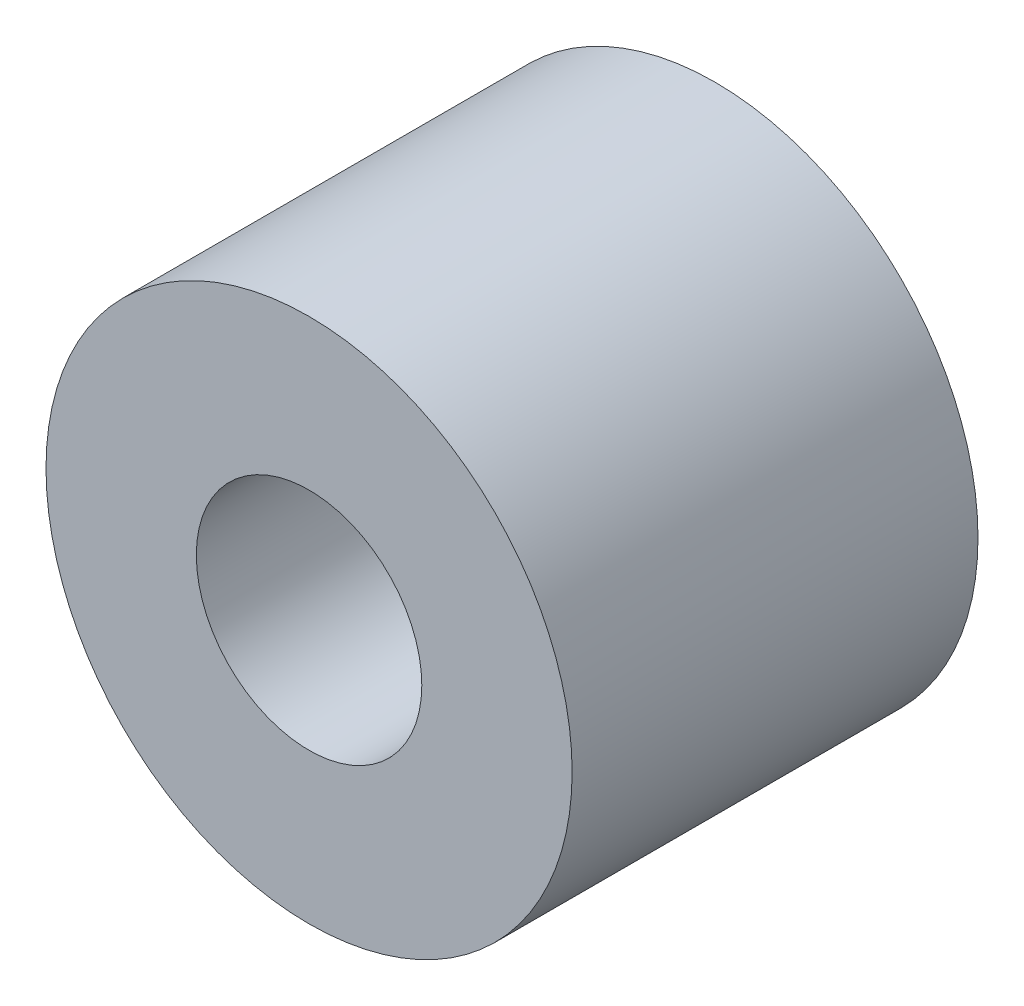
ISO-10303-21;
HEADER;
FILE_DESCRIPTION(('STEP AP214'),'2;1');
FILE_NAME('part.step','',(''),(''),'','','');
FILE_SCHEMA(('AUTOMOTIVE_DESIGN { 1 0 10303 214 1 1 1 1 }'));
ENDSEC;
DATA;
#1=APPLICATION_CONTEXT('core data for automotive mechanical design processes');
#2=APPLICATION_PROTOCOL_DEFINITION('international standard','automotive_design',2000,#1);
#3=PRODUCT_CONTEXT('',#1,'mechanical');
#4=PRODUCT('Part','Part','',(#3));
#5=PRODUCT_RELATED_PRODUCT_CATEGORY('part','',(#4));
#6=PRODUCT_DEFINITION_FORMATION('','',#4);
#7=PRODUCT_DEFINITION_CONTEXT('part definition',#1,'design');
#8=PRODUCT_DEFINITION('design','',#6,#7);
#9=PRODUCT_DEFINITION_SHAPE('','',#8);
#10=(LENGTH_UNIT() NAMED_UNIT(*) SI_UNIT(.MILLI.,.METRE.));
#11=(NAMED_UNIT(*) PLANE_ANGLE_UNIT() SI_UNIT($,.RADIAN.));
#12=(NAMED_UNIT(*) SI_UNIT($,.STERADIAN.) SOLID_ANGLE_UNIT());
#13=UNCERTAINTY_MEASURE_WITH_UNIT(LENGTH_MEASURE(1.E-05),#10,'distance_accuracy_value','');
#14=(GEOMETRIC_REPRESENTATION_CONTEXT(3) GLOBAL_UNCERTAINTY_ASSIGNED_CONTEXT((#13)) GLOBAL_UNIT_ASSIGNED_CONTEXT((#10,
#11,#12)) REPRESENTATION_CONTEXT('',''));
#15=CARTESIAN_POINT('',(0.,0.,0.));
#16=DIRECTION('',(0.,0.,1.));
#17=DIRECTION('',(1.,0.,0.));
#18=AXIS2_PLACEMENT_3D('',#15,#16,#17);
#19=CARTESIAN_POINT('',(0.,0.,5.4));
#20=DIRECTION('',(0.,0.,1.));
#21=DIRECTION('',(1.,0.,0.));
#22=AXIS2_PLACEMENT_3D('',#19,#20,#21);
#23=PLANE('',#22);
#24=CARTESIAN_POINT('',(0.,0.,5.4));
#25=DIRECTION('',(0.,0.,1.));
#26=DIRECTION('',(1.,0.,0.));
#27=AXIS2_PLACEMENT_3D('',#24,#25,#26);
#28=CIRCLE('',#27,3.5);
#29=CARTESIAN_POINT('',(3.5,0.,5.4));
#30=VERTEX_POINT('',#29);
#31=EDGE_CURVE('E10',#30,#30,#28,.T.);
#32=ORIENTED_EDGE('',*,*,#31,.T.);
#33=EDGE_LOOP('',(#32));
#34=FACE_BOUND('',#33,.T.);
#35=CARTESIAN_POINT('',(0.,0.,5.4));
#36=DIRECTION('',(0.,0.,1.));
#37=DIRECTION('',(1.,0.,0.));
#38=AXIS2_PLACEMENT_3D('',#35,#36,#37);
#39=CIRCLE('',#38,1.5);
#40=CARTESIAN_POINT('',(1.5,0.,5.4));
#41=VERTEX_POINT('',#40);
#42=EDGE_CURVE('E54',#41,#41,#39,.T.);
#43=ORIENTED_EDGE('',*,*,#42,.F.);
#44=EDGE_LOOP('',(#43));
#45=FACE_BOUND('',#44,.T.);
#46=ADVANCED_FACE('F41',(#34,#45),#23,.T.);
#47=CARTESIAN_POINT('',(0.,0.,0.));
#48=DIRECTION('',(0.,0.,1.));
#49=DIRECTION('',(1.,0.,0.));
#50=AXIS2_PLACEMENT_3D('',#47,#48,#49);
#51=PLANE('',#50);
#52=CARTESIAN_POINT('',(0.,0.,0.));
#53=DIRECTION('',(0.,0.,1.));
#54=DIRECTION('',(1.,0.,0.));
#55=AXIS2_PLACEMENT_3D('',#52,#53,#54);
#56=CIRCLE('',#55,3.5);
#57=CARTESIAN_POINT('',(3.5,0.,0.));
#58=VERTEX_POINT('',#57);
#59=EDGE_CURVE('E45',#58,#58,#56,.T.);
#60=ORIENTED_EDGE('',*,*,#59,.F.);
#61=EDGE_LOOP('',(#60));
#62=FACE_BOUND('',#61,.T.);
#63=CARTESIAN_POINT('',(0.,0.,0.));
#64=DIRECTION('',(0.,0.,1.));
#65=DIRECTION('',(1.,0.,0.));
#66=AXIS2_PLACEMENT_3D('',#63,#64,#65);
#67=CIRCLE('',#66,1.5);
#68=CARTESIAN_POINT('',(1.5,0.,0.));
#69=VERTEX_POINT('',#68);
#70=EDGE_CURVE('E56',#69,#69,#67,.T.);
#71=ORIENTED_EDGE('',*,*,#70,.T.);
#72=EDGE_LOOP('',(#71));
#73=FACE_BOUND('',#72,.T.);
#74=ADVANCED_FACE('F68',(#62,#73),#51,.F.);
#75=CARTESIAN_POINT('',(0.,0.,5.4));
#76=DIRECTION('',(0.,0.,-1.));
#77=DIRECTION('',(-1.,0.,0.));
#78=AXIS2_PLACEMENT_3D('',#75,#76,#77);
#79=CYLINDRICAL_SURFACE('',#78,3.5);
#80=ORIENTED_EDGE('',*,*,#31,.F.);
#81=EDGE_LOOP('',(#80));
#82=FACE_BOUND('',#81,.T.);
#83=ORIENTED_EDGE('',*,*,#59,.T.);
#84=EDGE_LOOP('',(#83));
#85=FACE_BOUND('',#84,.T.);
#86=ADVANCED_FACE('F43',(#82,#85),#79,.T.);
#87=CARTESIAN_POINT('',(0.,0.,5.4));
#88=DIRECTION('',(0.,0.,-1.));
#89=DIRECTION('',(-1.,0.,0.));
#90=AXIS2_PLACEMENT_3D('',#87,#88,#89);
#91=CYLINDRICAL_SURFACE('',#90,1.5);
#92=ORIENTED_EDGE('',*,*,#42,.T.);
#93=EDGE_LOOP('',(#92));
#94=FACE_BOUND('',#93,.T.);
#95=ORIENTED_EDGE('',*,*,#70,.F.);
#96=EDGE_LOOP('',(#95));
#97=FACE_BOUND('',#96,.T.);
#98=ADVANCED_FACE('F64',(#94,#97),#91,.F.);
#99=CLOSED_SHELL('',(#46,#74,#86,#98));
#100=MANIFOLD_SOLID_BREP('B2',#99);
#101=ADVANCED_BREP_SHAPE_REPRESENTATION('',(#18,#100),#14);
#102=SHAPE_DEFINITION_REPRESENTATION(#9,#101);
ENDSEC;
END-ISO-10303-21;
